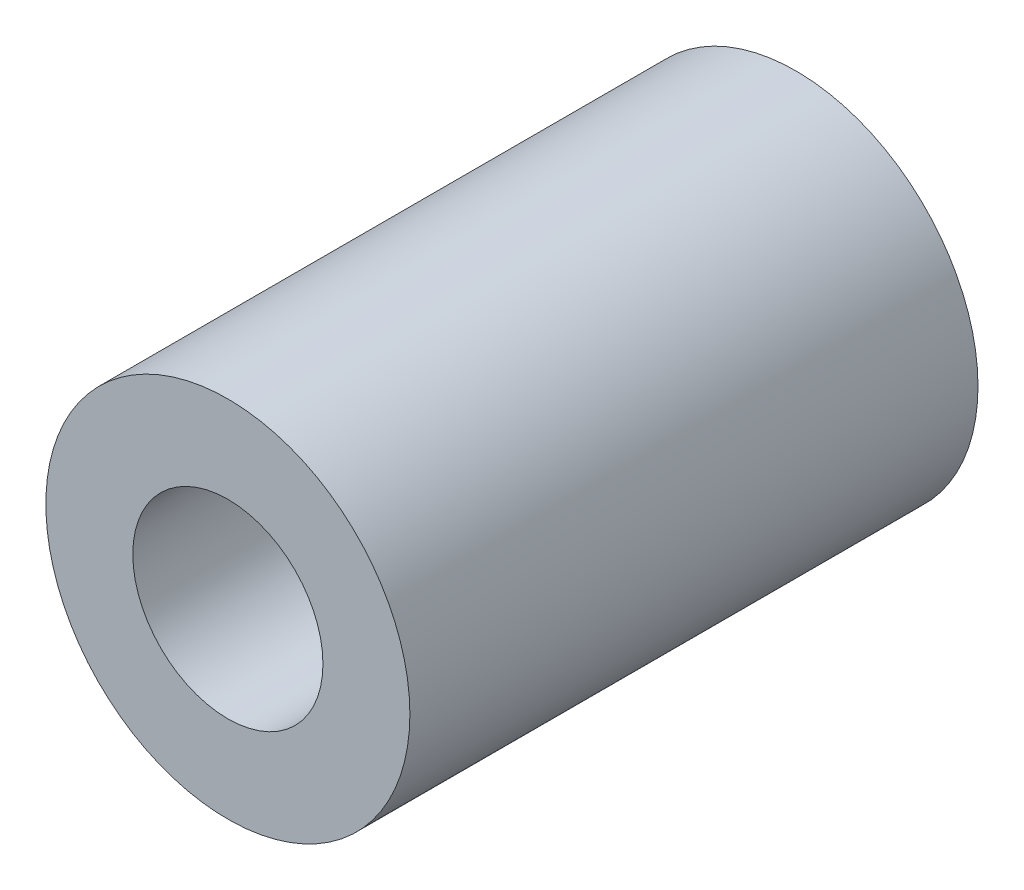
ISO-10303-21;
HEADER;
FILE_DESCRIPTION(('STEP AP214'),'2;1');
FILE_NAME('part.step','',(''),(''),'','','');
FILE_SCHEMA(('AUTOMOTIVE_DESIGN { 1 0 10303 214 1 1 1 1 }'));
ENDSEC;
DATA;
#1=APPLICATION_CONTEXT('core data for automotive mechanical design processes');
#2=APPLICATION_PROTOCOL_DEFINITION('international standard','automotive_design',2000,#1);
#3=PRODUCT_CONTEXT('',#1,'mechanical');
#4=PRODUCT('Part','Part','',(#3));
#5=PRODUCT_RELATED_PRODUCT_CATEGORY('part','',(#4));
#6=PRODUCT_DEFINITION_FORMATION('','',#4);
#7=PRODUCT_DEFINITION_CONTEXT('part definition',#1,'design');
#8=PRODUCT_DEFINITION('design','',#6,#7);
#9=PRODUCT_DEFINITION_SHAPE('','',#8);
#10=(LENGTH_UNIT() NAMED_UNIT(*) SI_UNIT(.MILLI.,.METRE.));
#11=(NAMED_UNIT(*) PLANE_ANGLE_UNIT() SI_UNIT($,.RADIAN.));
#12=(NAMED_UNIT(*) SI_UNIT($,.STERADIAN.) SOLID_ANGLE_UNIT());
#13=UNCERTAINTY_MEASURE_WITH_UNIT(LENGTH_MEASURE(1.E-05),#10,'distance_accuracy_value','');
#14=(GEOMETRIC_REPRESENTATION_CONTEXT(3) GLOBAL_UNCERTAINTY_ASSIGNED_CONTEXT((#13)) GLOBAL_UNIT_ASSIGNED_CONTEXT((#10,
#11,#12)) REPRESENTATION_CONTEXT('',''));
#15=CARTESIAN_POINT('',(0.,0.,0.));
#16=DIRECTION('',(0.,0.,1.));
#17=DIRECTION('',(1.,0.,0.));
#18=AXIS2_PLACEMENT_3D('',#15,#16,#17);
#19=CARTESIAN_POINT('',(0.,0.,24.5));
#20=DIRECTION('',(0.,0.,1.));
#21=DIRECTION('',(1.,0.,0.));
#22=AXIS2_PLACEMENT_3D('',#19,#20,#21);
#23=PLANE('',#22);
#24=CARTESIAN_POINT('',(0.,0.,24.5));
#25=DIRECTION('',(0.,0.,1.));
#26=DIRECTION('',(1.,0.,0.));
#27=AXIS2_PLACEMENT_3D('',#24,#25,#26);
#28=CIRCLE('',#27,7.85);
#29=CARTESIAN_POINT('',(7.85,0.,24.5));
#30=VERTEX_POINT('',#29);
#31=EDGE_CURVE('E10',#30,#30,#28,.T.);
#32=ORIENTED_EDGE('',*,*,#31,.T.);
#33=EDGE_LOOP('',(#32));
#34=FACE_BOUND('',#33,.T.);
#35=CARTESIAN_POINT('',(0.,0.,24.5));
#36=DIRECTION('',(0.,0.,1.));
#37=DIRECTION('',(1.,0.,0.));
#38=AXIS2_PLACEMENT_3D('',#35,#36,#37);
#39=CIRCLE('',#38,4.1);
#40=CARTESIAN_POINT('',(4.1,0.,24.5));
#41=VERTEX_POINT('',#40);
#42=EDGE_CURVE('E43',#41,#41,#39,.T.);
#43=ORIENTED_EDGE('',*,*,#42,.F.);
#44=EDGE_LOOP('',(#43));
#45=FACE_BOUND('',#44,.T.);
#46=ADVANCED_FACE('F32',(#34,#45),#23,.T.);
#47=CARTESIAN_POINT('',(0.,0.,0.));
#48=DIRECTION('',(0.,0.,1.));
#49=DIRECTION('',(1.,0.,0.));
#50=AXIS2_PLACEMENT_3D('',#47,#48,#49);
#51=PLANE('',#50);
#52=CARTESIAN_POINT('',(0.,0.,0.));
#53=DIRECTION('',(0.,0.,1.));
#54=DIRECTION('',(1.,0.,0.));
#55=AXIS2_PLACEMENT_3D('',#52,#53,#54);
#56=CIRCLE('',#55,7.85);
#57=CARTESIAN_POINT('',(7.85,0.,0.));
#58=VERTEX_POINT('',#57);
#59=EDGE_CURVE('E36',#58,#58,#56,.T.);
#60=ORIENTED_EDGE('',*,*,#59,.F.);
#61=EDGE_LOOP('',(#60));
#62=FACE_BOUND('',#61,.T.);
#63=CARTESIAN_POINT('',(0.,0.,0.));
#64=DIRECTION('',(0.,0.,1.));
#65=DIRECTION('',(1.,0.,0.));
#66=AXIS2_PLACEMENT_3D('',#63,#64,#65);
#67=CIRCLE('',#66,4.1);
#68=CARTESIAN_POINT('',(4.1,0.,0.));
#69=VERTEX_POINT('',#68);
#70=EDGE_CURVE('E45',#69,#69,#67,.T.);
#71=ORIENTED_EDGE('',*,*,#70,.T.);
#72=EDGE_LOOP('',(#71));
#73=FACE_BOUND('',#72,.T.);
#74=ADVANCED_FACE('F55',(#62,#73),#51,.F.);
#75=CARTESIAN_POINT('',(0.,0.,24.5));
#76=DIRECTION('',(0.,0.,-1.));
#77=DIRECTION('',(-1.,0.,0.));
#78=AXIS2_PLACEMENT_3D('',#75,#76,#77);
#79=CYLINDRICAL_SURFACE('',#78,7.85);
#80=ORIENTED_EDGE('',*,*,#31,.F.);
#81=EDGE_LOOP('',(#80));
#82=FACE_BOUND('',#81,.T.);
#83=ORIENTED_EDGE('',*,*,#59,.T.);
#84=EDGE_LOOP('',(#83));
#85=FACE_BOUND('',#84,.T.);
#86=ADVANCED_FACE('F34',(#82,#85),#79,.T.);
#87=CARTESIAN_POINT('',(0.,0.,24.5));
#88=DIRECTION('',(0.,0.,-1.));
#89=DIRECTION('',(-1.,0.,0.));
#90=AXIS2_PLACEMENT_3D('',#87,#88,#89);
#91=CYLINDRICAL_SURFACE('',#90,4.1);
#92=ORIENTED_EDGE('',*,*,#42,.T.);
#93=EDGE_LOOP('',(#92));
#94=FACE_BOUND('',#93,.T.);
#95=ORIENTED_EDGE('',*,*,#70,.F.);
#96=EDGE_LOOP('',(#95));
#97=FACE_BOUND('',#96,.T.);
#98=ADVANCED_FACE('F51',(#94,#97),#91,.F.);
#99=CLOSED_SHELL('',(#46,#74,#86,#98));
#100=MANIFOLD_SOLID_BREP('B2',#99);
#101=ADVANCED_BREP_SHAPE_REPRESENTATION('',(#18,#100),#14);
#102=SHAPE_DEFINITION_REPRESENTATION(#9,#101);
ENDSEC;
END-ISO-10303-21;
